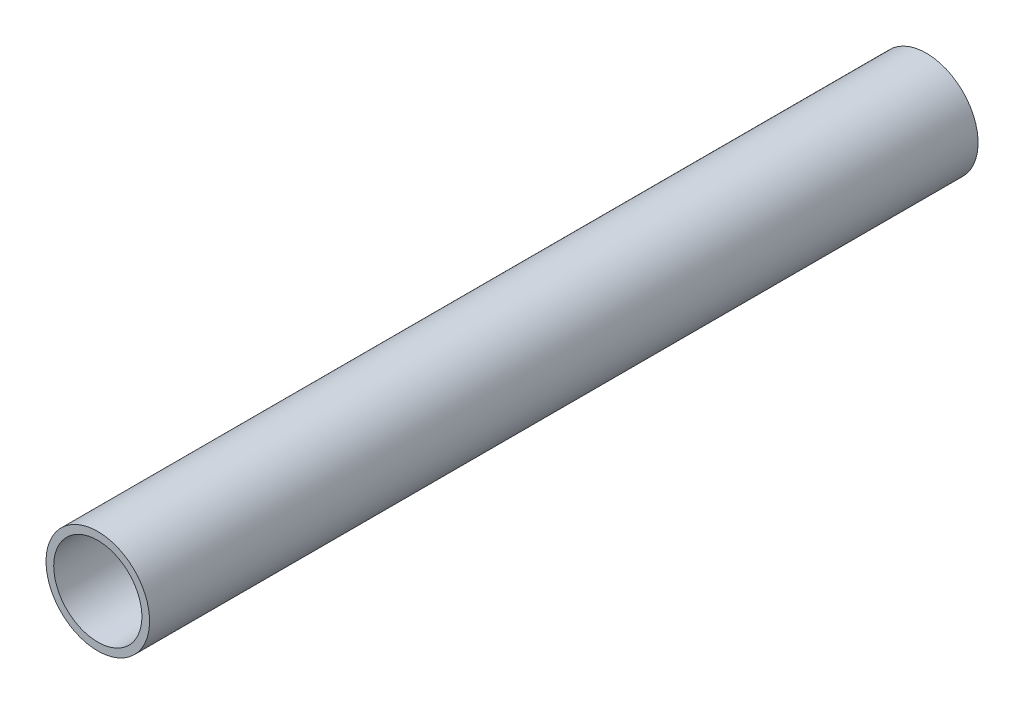
ISO-10303-21;
HEADER;
FILE_DESCRIPTION(('STEP AP214'),'2;1');
FILE_NAME('part.step','',(''),(''),'','','');
FILE_SCHEMA(('AUTOMOTIVE_DESIGN { 1 0 10303 214 1 1 1 1 }'));
ENDSEC;
DATA;
#1=APPLICATION_CONTEXT('core data for automotive mechanical design processes');
#2=APPLICATION_PROTOCOL_DEFINITION('international standard','automotive_design',2000,#1);
#3=PRODUCT_CONTEXT('',#1,'mechanical');
#4=PRODUCT('Part','Part','',(#3));
#5=PRODUCT_RELATED_PRODUCT_CATEGORY('part','',(#4));
#6=PRODUCT_DEFINITION_FORMATION('','',#4);
#7=PRODUCT_DEFINITION_CONTEXT('part definition',#1,'design');
#8=PRODUCT_DEFINITION('design','',#6,#7);
#9=PRODUCT_DEFINITION_SHAPE('','',#8);
#10=(LENGTH_UNIT() NAMED_UNIT(*) SI_UNIT(.MILLI.,.METRE.));
#11=(NAMED_UNIT(*) PLANE_ANGLE_UNIT() SI_UNIT($,.RADIAN.));
#12=(NAMED_UNIT(*) SI_UNIT($,.STERADIAN.) SOLID_ANGLE_UNIT());
#13=UNCERTAINTY_MEASURE_WITH_UNIT(LENGTH_MEASURE(1.E-05),#10,'distance_accuracy_value','');
#14=(GEOMETRIC_REPRESENTATION_CONTEXT(3) GLOBAL_UNCERTAINTY_ASSIGNED_CONTEXT((#13)) GLOBAL_UNIT_ASSIGNED_CONTEXT((#10,
#11,#12)) REPRESENTATION_CONTEXT('',''));
#15=CARTESIAN_POINT('',(0.,0.,0.));
#16=DIRECTION('',(0.,0.,1.));
#17=DIRECTION('',(1.,0.,0.));
#18=AXIS2_PLACEMENT_3D('',#15,#16,#17);
#19=CARTESIAN_POINT('',(355.6,177.8,-1492.25));
#20=DIRECTION('',(0.,0.,1.));
#21=DIRECTION('',(1.,0.,0.));
#22=AXIS2_PLACEMENT_3D('',#19,#20,#21);
#23=CYLINDRICAL_SURFACE('',#22,9.46149999999999);
#24=CARTESIAN_POINT('',(355.6,177.8,-1492.25));
#25=DIRECTION('',(0.,0.,-1.));
#26=DIRECTION('',(-1.,0.,0.));
#27=AXIS2_PLACEMENT_3D('',#24,#25,#26);
#28=CIRCLE('',#27,9.46149999999999);
#29=CARTESIAN_POINT('',(346.1385,177.8,-1492.25));
#30=VERTEX_POINT('',#29);
#31=EDGE_CURVE('E57',#30,#30,#28,.T.);
#32=ORIENTED_EDGE('',*,*,#31,.T.);
#33=EDGE_LOOP('',(#32));
#34=FACE_BOUND('',#33,.T.);
#35=CARTESIAN_POINT('',(355.6,177.8,-1314.45));
#36=DIRECTION('',(0.,0.,-1.));
#37=DIRECTION('',(-1.,0.,0.));
#38=AXIS2_PLACEMENT_3D('',#35,#36,#37);
#39=CIRCLE('',#38,9.46149999999999);
#40=CARTESIAN_POINT('',(346.1385,177.8,-1314.45));
#41=VERTEX_POINT('',#40);
#42=EDGE_CURVE('E64',#41,#41,#39,.T.);
#43=ORIENTED_EDGE('',*,*,#42,.F.);
#44=EDGE_LOOP('',(#43));
#45=FACE_BOUND('',#44,.T.);
#46=ADVANCED_FACE('F49',(#34,#45),#23,.F.);
#47=CARTESIAN_POINT('',(355.6,177.8,-1492.25));
#48=DIRECTION('',(0.,0.,1.));
#49=DIRECTION('',(1.,0.,0.));
#50=AXIS2_PLACEMENT_3D('',#47,#48,#49);
#51=CYLINDRICAL_SURFACE('',#50,11.1125);
#52=CARTESIAN_POINT('',(355.6,177.8,-1492.25));
#53=DIRECTION('',(0.,0.,-1.));
#54=DIRECTION('',(-1.,0.,0.));
#55=AXIS2_PLACEMENT_3D('',#52,#53,#54);
#56=CIRCLE('',#55,11.1125);
#57=CARTESIAN_POINT('',(344.487499999999,177.8,-1492.25));
#58=VERTEX_POINT('',#57);
#59=EDGE_CURVE('E11',#58,#58,#56,.T.);
#60=ORIENTED_EDGE('',*,*,#59,.F.);
#61=EDGE_LOOP('',(#60));
#62=FACE_BOUND('',#61,.T.);
#63=CARTESIAN_POINT('',(355.6,177.8,-1314.45));
#64=DIRECTION('',(0.,0.,-1.));
#65=DIRECTION('',(-1.,0.,0.));
#66=AXIS2_PLACEMENT_3D('',#63,#64,#65);
#67=CIRCLE('',#66,11.1125);
#68=CARTESIAN_POINT('',(344.4875,177.8,-1314.45));
#69=VERTEX_POINT('',#68);
#70=EDGE_CURVE('E52',#69,#69,#67,.T.);
#71=ORIENTED_EDGE('',*,*,#70,.T.);
#72=EDGE_LOOP('',(#71));
#73=FACE_BOUND('',#72,.T.);
#74=ADVANCED_FACE('F73',(#62,#73),#51,.T.);
#75=CARTESIAN_POINT('',(355.6,177.8,-1492.25));
#76=DIRECTION('',(0.,0.,-1.));
#77=DIRECTION('',(-1.,0.,0.));
#78=AXIS2_PLACEMENT_3D('',#75,#76,#77);
#79=PLANE('',#78);
#80=ORIENTED_EDGE('',*,*,#31,.F.);
#81=EDGE_LOOP('',(#80));
#82=FACE_BOUND('',#81,.T.);
#83=ORIENTED_EDGE('',*,*,#59,.T.);
#84=EDGE_LOOP('',(#83));
#85=FACE_BOUND('',#84,.T.);
#86=ADVANCED_FACE('F77',(#82,#85),#79,.T.);
#87=CARTESIAN_POINT('',(355.6,177.8,-1314.45));
#88=DIRECTION('',(0.,0.,-1.));
#89=DIRECTION('',(-1.,0.,0.));
#90=AXIS2_PLACEMENT_3D('',#87,#88,#89);
#91=PLANE('',#90);
#92=ORIENTED_EDGE('',*,*,#42,.T.);
#93=EDGE_LOOP('',(#92));
#94=FACE_BOUND('',#93,.T.);
#95=ORIENTED_EDGE('',*,*,#70,.F.);
#96=EDGE_LOOP('',(#95));
#97=FACE_BOUND('',#96,.T.);
#98=ADVANCED_FACE('F75',(#94,#97),#91,.F.);
#99=CLOSED_SHELL('',(#46,#74,#86,#98));
#100=MANIFOLD_SOLID_BREP('B2',#99);
#101=ADVANCED_BREP_SHAPE_REPRESENTATION('',(#18,#100),#14);
#102=SHAPE_DEFINITION_REPRESENTATION(#9,#101);
ENDSEC;
END-ISO-10303-21;
